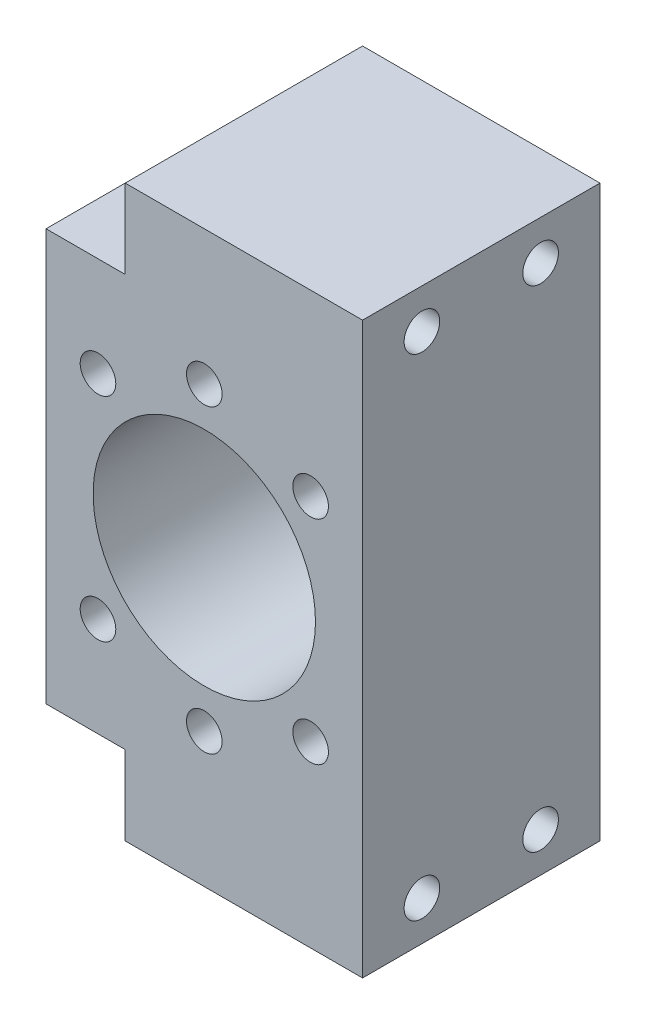
ISO-10303-21;
HEADER;
FILE_DESCRIPTION(('STEP AP214'),'2;1');
FILE_NAME('part.step','',(''),(''),'','','');
FILE_SCHEMA(('AUTOMOTIVE_DESIGN { 1 0 10303 214 1 1 1 1 }'));
ENDSEC;
DATA;
#1=APPLICATION_CONTEXT('core data for automotive mechanical design processes');
#2=APPLICATION_PROTOCOL_DEFINITION('international standard','automotive_design',2000,#1);
#3=PRODUCT_CONTEXT('',#1,'mechanical');
#4=PRODUCT('Part','Part','',(#3));
#5=PRODUCT_RELATED_PRODUCT_CATEGORY('part','',(#4));
#6=PRODUCT_DEFINITION_FORMATION('','',#4);
#7=PRODUCT_DEFINITION_CONTEXT('part definition',#1,'design');
#8=PRODUCT_DEFINITION('design','',#6,#7);
#9=PRODUCT_DEFINITION_SHAPE('','',#8);
#10=(LENGTH_UNIT() NAMED_UNIT(*) SI_UNIT(.MILLI.,.METRE.));
#11=(NAMED_UNIT(*) PLANE_ANGLE_UNIT() SI_UNIT($,.RADIAN.));
#12=(NAMED_UNIT(*) SI_UNIT($,.STERADIAN.) SOLID_ANGLE_UNIT());
#13=UNCERTAINTY_MEASURE_WITH_UNIT(LENGTH_MEASURE(1.E-05),#10,'distance_accuracy_value','');
#14=(GEOMETRIC_REPRESENTATION_CONTEXT(3) GLOBAL_UNCERTAINTY_ASSIGNED_CONTEXT((#13)) GLOBAL_UNIT_ASSIGNED_CONTEXT((#10,
#11,#12)) REPRESENTATION_CONTEXT('',''));
#15=CARTESIAN_POINT('',(0.,0.,0.));
#16=DIRECTION('',(0.,0.,1.));
#17=DIRECTION('',(1.,0.,0.));
#18=AXIS2_PLACEMENT_3D('',#15,#16,#17);
#19=CARTESIAN_POINT('',(-20.,36.,40.));
#20=DIRECTION('',(0.,-1.,0.));
#21=DIRECTION('',(0.,0.,-1.));
#22=AXIS2_PLACEMENT_3D('',#19,#20,#21);
#23=PLANE('',#22);
#24=DIRECTION('',(0.,0.,-1.));
#25=VECTOR('',#24,1.);
#26=CARTESIAN_POINT('',(-10.,36.,10.));
#27=LINE('',#26,#25);
#28=CARTESIAN_POINT('',(-10.,36.,40.));
#29=VERTEX_POINT('',#28);
#30=CARTESIAN_POINT('',(-10.,36.,10.));
#31=VERTEX_POINT('',#30);
#32=EDGE_CURVE('E220',#29,#31,#27,.T.);
#33=ORIENTED_EDGE('',*,*,#32,.F.);
#34=DIRECTION('',(-1.,0.,0.));
#35=VECTOR('',#34,1.);
#36=CARTESIAN_POINT('',(-20.,36.,40.));
#37=LINE('',#36,#35);
#38=CARTESIAN_POINT('',(20.,36.,40.));
#39=VERTEX_POINT('',#38);
#40=EDGE_CURVE('E127',#39,#29,#37,.T.);
#41=ORIENTED_EDGE('',*,*,#40,.F.);
#42=DIRECTION('',(0.,0.,-1.));
#43=VECTOR('',#42,1.);
#44=CARTESIAN_POINT('',(20.,36.,40.));
#45=LINE('',#44,#43);
#46=CARTESIAN_POINT('',(20.,36.,10.));
#47=VERTEX_POINT('',#46);
#48=EDGE_CURVE('E12',#39,#47,#45,.T.);
#49=ORIENTED_EDGE('',*,*,#48,.T.);
#50=DIRECTION('',(-1.,0.,0.));
#51=VECTOR('',#50,1.);
#52=CARTESIAN_POINT('',(-20.,36.,10.));
#53=LINE('',#52,#51);
#54=EDGE_CURVE('E153',#47,#31,#53,.T.);
#55=ORIENTED_EDGE('',*,*,#54,.T.);
#56=EDGE_LOOP('',(#33,#41,#49,#55));
#57=FACE_BOUND('',#56,.T.);
#58=ADVANCED_FACE('F37',(#57),#23,.F.);
#59=CARTESIAN_POINT('',(20.,-36.,40.));
#60=DIRECTION('',(0.,0.,-1.));
#61=DIRECTION('',(-1.,0.,0.));
#62=AXIS2_PLACEMENT_3D('',#59,#60,#61);
#63=PLANE('',#62);
#64=CARTESIAN_POINT('',(13.4350288425444,-13.4350288425444,40.));
#65=DIRECTION('',(0.,0.,1.));
#66=DIRECTION('',(1.,0.,0.));
#67=AXIS2_PLACEMENT_3D('',#64,#65,#66);
#68=CIRCLE('',#67,2.25);
#69=CARTESIAN_POINT('',(15.6850288425444,-13.4350288425444,40.));
#70=VERTEX_POINT('',#69);
#71=EDGE_CURVE('E189',#70,#70,#68,.T.);
#72=ORIENTED_EDGE('',*,*,#71,.F.);
#73=EDGE_LOOP('',(#72));
#74=FACE_BOUND('',#73,.T.);
#75=CARTESIAN_POINT('',(-13.4350288425444,-13.4350288425444,40.));
#76=DIRECTION('',(0.,0.,1.));
#77=DIRECTION('',(1.,0.,0.));
#78=AXIS2_PLACEMENT_3D('',#75,#76,#77);
#79=CIRCLE('',#78,2.25);
#80=CARTESIAN_POINT('',(-11.1850288425444,-13.4350288425444,40.));
#81=VERTEX_POINT('',#80);
#82=EDGE_CURVE('E177',#81,#81,#79,.T.);
#83=ORIENTED_EDGE('',*,*,#82,.F.);
#84=EDGE_LOOP('',(#83));
#85=FACE_BOUND('',#84,.T.);
#86=CARTESIAN_POINT('',(0.,19.,40.));
#87=DIRECTION('',(0.,0.,1.));
#88=DIRECTION('',(1.,0.,0.));
#89=AXIS2_PLACEMENT_3D('',#86,#87,#88);
#90=CIRCLE('',#89,2.25);
#91=CARTESIAN_POINT('',(2.25,19.,40.));
#92=VERTEX_POINT('',#91);
#93=EDGE_CURVE('E165',#92,#92,#90,.T.);
#94=ORIENTED_EDGE('',*,*,#93,.F.);
#95=EDGE_LOOP('',(#94));
#96=FACE_BOUND('',#95,.T.);
#97=DIRECTION('',(0.,-1.,0.));
#98=VECTOR('',#97,1.);
#99=CARTESIAN_POINT('',(-20.,-36.,40.));
#100=LINE('',#99,#98);
#101=CARTESIAN_POINT('',(-20.,26.,40.));
#102=VERTEX_POINT('',#101);
#103=CARTESIAN_POINT('',(-20.,-26.,40.));
#104=VERTEX_POINT('',#103);
#105=EDGE_CURVE('E117',#102,#104,#100,.T.);
#106=ORIENTED_EDGE('',*,*,#105,.T.);
#107=DIRECTION('',(-1.,0.,0.));
#108=VECTOR('',#107,1.);
#109=CARTESIAN_POINT('',(-10.,-26.,40.));
#110=LINE('',#109,#108);
#111=CARTESIAN_POINT('',(-10.,-26.,40.));
#112=VERTEX_POINT('',#111);
#113=EDGE_CURVE('E102',#112,#104,#110,.T.);
#114=ORIENTED_EDGE('',*,*,#113,.F.);
#115=DIRECTION('',(0.,1.,0.));
#116=VECTOR('',#115,1.);
#117=CARTESIAN_POINT('',(-10.,-36.,40.));
#118=LINE('',#117,#116);
#119=CARTESIAN_POINT('',(-10.,-36.,40.));
#120=VERTEX_POINT('',#119);
#121=EDGE_CURVE('E241',#120,#112,#118,.T.);
#122=ORIENTED_EDGE('',*,*,#121,.F.);
#123=DIRECTION('',(1.,0.,0.));
#124=VECTOR('',#123,1.);
#125=CARTESIAN_POINT('',(20.,-36.,40.));
#126=LINE('',#125,#124);
#127=CARTESIAN_POINT('',(20.,-36.,40.));
#128=VERTEX_POINT('',#127);
#129=EDGE_CURVE('E126',#120,#128,#126,.T.);
#130=ORIENTED_EDGE('',*,*,#129,.T.);
#131=DIRECTION('',(0.,1.,0.));
#132=VECTOR('',#131,1.);
#133=CARTESIAN_POINT('',(20.,36.,40.));
#134=LINE('',#133,#132);
#135=EDGE_CURVE('E131',#128,#39,#134,.T.);
#136=ORIENTED_EDGE('',*,*,#135,.T.);
#137=ORIENTED_EDGE('',*,*,#40,.T.);
#138=DIRECTION('',(0.,1.,0.));
#139=VECTOR('',#138,1.);
#140=CARTESIAN_POINT('',(-10.,36.,40.));
#141=LINE('',#140,#139);
#142=CARTESIAN_POINT('',(-10.,26.,40.));
#143=VERTEX_POINT('',#142);
#144=EDGE_CURVE('E223',#143,#29,#141,.T.);
#145=ORIENTED_EDGE('',*,*,#144,.F.);
#146=DIRECTION('',(-1.,0.,0.));
#147=VECTOR('',#146,1.);
#148=CARTESIAN_POINT('',(-10.,26.,40.));
#149=LINE('',#148,#147);
#150=EDGE_CURVE('E125',#143,#102,#149,.T.);
#151=ORIENTED_EDGE('',*,*,#150,.T.);
#152=EDGE_LOOP('',(#106,#114,#122,#130,#136,#137,#145,#151));
#153=FACE_BOUND('',#152,.T.);
#154=CARTESIAN_POINT('',(13.4350288425444,13.4350288425444,40.));
#155=DIRECTION('',(0.,0.,1.));
#156=DIRECTION('',(1.,0.,0.));
#157=AXIS2_PLACEMENT_3D('',#154,#155,#156);
#158=CIRCLE('',#157,2.25);
#159=CARTESIAN_POINT('',(15.6850288425444,13.4350288425444,40.));
#160=VERTEX_POINT('',#159);
#161=EDGE_CURVE('E159',#160,#160,#158,.T.);
#162=ORIENTED_EDGE('',*,*,#161,.F.);
#163=EDGE_LOOP('',(#162));
#164=FACE_BOUND('',#163,.T.);
#165=CARTESIAN_POINT('',(-13.4350288425445,13.4350288425444,40.));
#166=DIRECTION('',(0.,0.,1.));
#167=DIRECTION('',(1.,0.,0.));
#168=AXIS2_PLACEMENT_3D('',#165,#166,#167);
#169=CIRCLE('',#168,2.25);
#170=CARTESIAN_POINT('',(-11.1850288425445,13.4350288425444,40.));
#171=VERTEX_POINT('',#170);
#172=EDGE_CURVE('E171',#171,#171,#169,.T.);
#173=ORIENTED_EDGE('',*,*,#172,.F.);
#174=EDGE_LOOP('',(#173));
#175=FACE_BOUND('',#174,.T.);
#176=CARTESIAN_POINT('',(0.,-19.,40.));
#177=DIRECTION('',(0.,0.,1.));
#178=DIRECTION('',(1.,0.,0.));
#179=AXIS2_PLACEMENT_3D('',#176,#177,#178);
#180=CIRCLE('',#179,2.25);
#181=CARTESIAN_POINT('',(2.25,-19.,40.));
#182=VERTEX_POINT('',#181);
#183=EDGE_CURVE('E183',#182,#182,#180,.T.);
#184=ORIENTED_EDGE('',*,*,#183,.F.);
#185=EDGE_LOOP('',(#184));
#186=FACE_BOUND('',#185,.T.);
#187=CARTESIAN_POINT('',(0.,0.,40.));
#188=DIRECTION('',(0.,0.,1.));
#189=DIRECTION('',(1.,0.,0.));
#190=AXIS2_PLACEMENT_3D('',#187,#188,#189);
#191=CIRCLE('',#190,14.05);
#192=CARTESIAN_POINT('',(14.05,0.,40.));
#193=VERTEX_POINT('',#192);
#194=EDGE_CURVE('E195',#193,#193,#191,.T.);
#195=ORIENTED_EDGE('',*,*,#194,.F.);
#196=EDGE_LOOP('',(#195));
#197=FACE_BOUND('',#196,.T.);
#198=ADVANCED_FACE('F122',(#74,#85,#96,#153,#164,#175,#186,#197),#63,.F.);
#199=CARTESIAN_POINT('',(20.,-36.,10.));
#200=DIRECTION('',(0.,0.,-1.));
#201=DIRECTION('',(-1.,0.,0.));
#202=AXIS2_PLACEMENT_3D('',#199,#200,#201);
#203=PLANE('',#202);
#204=DIRECTION('',(-1.,0.,0.));
#205=VECTOR('',#204,1.);
#206=CARTESIAN_POINT('',(-10.,-26.,10.));
#207=LINE('',#206,#205);
#208=CARTESIAN_POINT('',(-10.,-26.,10.));
#209=VERTEX_POINT('',#208);
#210=CARTESIAN_POINT('',(-20.,-26.,10.));
#211=VERTEX_POINT('',#210);
#212=EDGE_CURVE('E111',#209,#211,#207,.T.);
#213=ORIENTED_EDGE('',*,*,#212,.T.);
#214=DIRECTION('',(0.,-1.,0.));
#215=VECTOR('',#214,1.);
#216=CARTESIAN_POINT('',(-20.,-36.,10.));
#217=LINE('',#216,#215);
#218=CARTESIAN_POINT('',(-20.,26.,10.));
#219=VERTEX_POINT('',#218);
#220=EDGE_CURVE('E119',#219,#211,#217,.T.);
#221=ORIENTED_EDGE('',*,*,#220,.F.);
#222=DIRECTION('',(-1.,0.,0.));
#223=VECTOR('',#222,1.);
#224=CARTESIAN_POINT('',(-10.,26.,10.));
#225=LINE('',#224,#223);
#226=CARTESIAN_POINT('',(-10.,26.,10.));
#227=VERTEX_POINT('',#226);
#228=EDGE_CURVE('E59',#227,#219,#225,.T.);
#229=ORIENTED_EDGE('',*,*,#228,.F.);
#230=DIRECTION('',(0.,-1.,0.));
#231=VECTOR('',#230,1.);
#232=CARTESIAN_POINT('',(-10.,36.,10.));
#233=LINE('',#232,#231);
#234=EDGE_CURVE('E228',#31,#227,#233,.T.);
#235=ORIENTED_EDGE('',*,*,#234,.F.);
#236=ORIENTED_EDGE('',*,*,#54,.F.);
#237=DIRECTION('',(0.,1.,0.));
#238=VECTOR('',#237,1.);
#239=CARTESIAN_POINT('',(20.,0.,10.));
#240=LINE('',#239,#238);
#241=CARTESIAN_POINT('',(20.,-36.,10.));
#242=VERTEX_POINT('',#241);
#243=EDGE_CURVE('E141',#242,#47,#240,.T.);
#244=ORIENTED_EDGE('',*,*,#243,.F.);
#245=DIRECTION('',(1.,0.,0.));
#246=VECTOR('',#245,1.);
#247=CARTESIAN_POINT('',(20.,-36.,10.));
#248=LINE('',#247,#246);
#249=CARTESIAN_POINT('',(-10.,-36.,10.));
#250=VERTEX_POINT('',#249);
#251=EDGE_CURVE('E150',#250,#242,#248,.T.);
#252=ORIENTED_EDGE('',*,*,#251,.F.);
#253=DIRECTION('',(0.,-1.,0.));
#254=VECTOR('',#253,1.);
#255=CARTESIAN_POINT('',(-10.,-36.,10.));
#256=LINE('',#255,#254);
#257=EDGE_CURVE('E51',#209,#250,#256,.T.);
#258=ORIENTED_EDGE('',*,*,#257,.F.);
#259=EDGE_LOOP('',(#213,#221,#229,#235,#236,#244,#252,#258));
#260=FACE_BOUND('',#259,.T.);
#261=CARTESIAN_POINT('',(13.4350288425444,-13.4350288425444,10.));
#262=DIRECTION('',(0.,0.,1.));
#263=DIRECTION('',(1.,0.,0.));
#264=AXIS2_PLACEMENT_3D('',#261,#262,#263);
#265=CIRCLE('',#264,2.25);
#266=CARTESIAN_POINT('',(15.6850288425444,-13.4350288425444,10.));
#267=VERTEX_POINT('',#266);
#268=EDGE_CURVE('E192',#267,#267,#265,.T.);
#269=ORIENTED_EDGE('',*,*,#268,.T.);
#270=EDGE_LOOP('',(#269));
#271=FACE_BOUND('',#270,.T.);
#272=CARTESIAN_POINT('',(-13.4350288425444,-13.4350288425444,10.));
#273=DIRECTION('',(0.,0.,1.));
#274=DIRECTION('',(1.,0.,0.));
#275=AXIS2_PLACEMENT_3D('',#272,#273,#274);
#276=CIRCLE('',#275,2.25);
#277=CARTESIAN_POINT('',(-11.1850288425444,-13.4350288425444,10.));
#278=VERTEX_POINT('',#277);
#279=EDGE_CURVE('E180',#278,#278,#276,.T.);
#280=ORIENTED_EDGE('',*,*,#279,.T.);
#281=EDGE_LOOP('',(#280));
#282=FACE_BOUND('',#281,.T.);
#283=CARTESIAN_POINT('',(0.,19.,10.));
#284=DIRECTION('',(0.,0.,1.));
#285=DIRECTION('',(1.,0.,0.));
#286=AXIS2_PLACEMENT_3D('',#283,#284,#285);
#287=CIRCLE('',#286,2.25);
#288=CARTESIAN_POINT('',(2.25,19.,10.));
#289=VERTEX_POINT('',#288);
#290=EDGE_CURVE('E168',#289,#289,#287,.T.);
#291=ORIENTED_EDGE('',*,*,#290,.T.);
#292=EDGE_LOOP('',(#291));
#293=FACE_BOUND('',#292,.T.);
#294=CARTESIAN_POINT('',(13.4350288425444,13.4350288425444,10.));
#295=DIRECTION('',(0.,0.,1.));
#296=DIRECTION('',(1.,0.,0.));
#297=AXIS2_PLACEMENT_3D('',#294,#295,#296);
#298=CIRCLE('',#297,2.25);
#299=CARTESIAN_POINT('',(15.6850288425444,13.4350288425444,10.));
#300=VERTEX_POINT('',#299);
#301=EDGE_CURVE('E162',#300,#300,#298,.T.);
#302=ORIENTED_EDGE('',*,*,#301,.T.);
#303=EDGE_LOOP('',(#302));
#304=FACE_BOUND('',#303,.T.);
#305=CARTESIAN_POINT('',(-13.4350288425445,13.4350288425444,10.));
#306=DIRECTION('',(0.,0.,1.));
#307=DIRECTION('',(1.,0.,0.));
#308=AXIS2_PLACEMENT_3D('',#305,#306,#307);
#309=CIRCLE('',#308,2.25);
#310=CARTESIAN_POINT('',(-11.1850288425445,13.4350288425444,10.));
#311=VERTEX_POINT('',#310);
#312=EDGE_CURVE('E174',#311,#311,#309,.T.);
#313=ORIENTED_EDGE('',*,*,#312,.T.);
#314=EDGE_LOOP('',(#313));
#315=FACE_BOUND('',#314,.T.);
#316=CARTESIAN_POINT('',(0.,-19.,10.));
#317=DIRECTION('',(0.,0.,1.));
#318=DIRECTION('',(1.,0.,0.));
#319=AXIS2_PLACEMENT_3D('',#316,#317,#318);
#320=CIRCLE('',#319,2.25);
#321=CARTESIAN_POINT('',(2.25,-19.,10.));
#322=VERTEX_POINT('',#321);
#323=EDGE_CURVE('E186',#322,#322,#320,.T.);
#324=ORIENTED_EDGE('',*,*,#323,.T.);
#325=EDGE_LOOP('',(#324));
#326=FACE_BOUND('',#325,.T.);
#327=CARTESIAN_POINT('',(0.,0.,10.));
#328=DIRECTION('',(0.,0.,1.));
#329=DIRECTION('',(1.,0.,0.));
#330=AXIS2_PLACEMENT_3D('',#327,#328,#329);
#331=CIRCLE('',#330,14.05);
#332=CARTESIAN_POINT('',(14.05,0.,10.));
#333=VERTEX_POINT('',#332);
#334=EDGE_CURVE('E198',#333,#333,#331,.T.);
#335=ORIENTED_EDGE('',*,*,#334,.T.);
#336=EDGE_LOOP('',(#335));
#337=FACE_BOUND('',#336,.T.);
#338=ADVANCED_FACE('F148',(#260,#271,#282,#293,#304,#315,#326,#337),#203,.T.);
#339=CARTESIAN_POINT('',(-20.,-36.,40.));
#340=DIRECTION('',(1.,0.,0.));
#341=DIRECTION('',(0.,0.,-1.));
#342=AXIS2_PLACEMENT_3D('',#339,#340,#341);
#343=PLANE('',#342);
#344=ORIENTED_EDGE('',*,*,#220,.T.);
#345=DIRECTION('',(0.,0.,-1.));
#346=VECTOR('',#345,1.);
#347=CARTESIAN_POINT('',(-20.,-26.,10.));
#348=LINE('',#347,#346);
#349=EDGE_CURVE('E105',#104,#211,#348,.T.);
#350=ORIENTED_EDGE('',*,*,#349,.F.);
#351=ORIENTED_EDGE('',*,*,#105,.F.);
#352=DIRECTION('',(0.,0.,1.));
#353=VECTOR('',#352,1.);
#354=CARTESIAN_POINT('',(-20.,26.,10.));
#355=LINE('',#354,#353);
#356=EDGE_CURVE('E231',#219,#102,#355,.T.);
#357=ORIENTED_EDGE('',*,*,#356,.F.);
#358=EDGE_LOOP('',(#344,#350,#351,#357));
#359=FACE_BOUND('',#358,.T.);
#360=ADVANCED_FACE('F116',(#359),#343,.F.);
#361=CARTESIAN_POINT('',(20.,-36.,40.));
#362=DIRECTION('',(0.,1.,0.));
#363=DIRECTION('',(0.,0.,1.));
#364=AXIS2_PLACEMENT_3D('',#361,#362,#363);
#365=PLANE('',#364);
#366=ORIENTED_EDGE('',*,*,#129,.F.);
#367=DIRECTION('',(0.,0.,1.));
#368=VECTOR('',#367,1.);
#369=CARTESIAN_POINT('',(-10.,-36.,10.));
#370=LINE('',#369,#368);
#371=EDGE_CURVE('E243',#250,#120,#370,.T.);
#372=ORIENTED_EDGE('',*,*,#371,.F.);
#373=ORIENTED_EDGE('',*,*,#251,.T.);
#374=DIRECTION('',(0.,0.,-1.));
#375=VECTOR('',#374,1.);
#376=CARTESIAN_POINT('',(20.,-36.,40.));
#377=LINE('',#376,#375);
#378=EDGE_CURVE('E44',#128,#242,#377,.T.);
#379=ORIENTED_EDGE('',*,*,#378,.F.);
#380=EDGE_LOOP('',(#366,#372,#373,#379));
#381=FACE_BOUND('',#380,.T.);
#382=ADVANCED_FACE('F247',(#381),#365,.F.);
#383=CARTESIAN_POINT('',(20.,0.,40.));
#384=DIRECTION('',(-1.,0.,0.));
#385=DIRECTION('',(0.,-1.,0.));
#386=AXIS2_PLACEMENT_3D('',#383,#384,#385);
#387=PLANE('',#386);
#388=CARTESIAN_POINT('',(20.,31.,17.5));
#389=DIRECTION('',(1.,0.,0.));
#390=DIRECTION('',(0.,0.,-1.));
#391=AXIS2_PLACEMENT_3D('',#388,#389,#390);
#392=CIRCLE('',#391,2.25);
#393=CARTESIAN_POINT('',(20.,31.,15.25));
#394=VERTEX_POINT('',#393);
#395=EDGE_CURVE('E210',#394,#394,#392,.T.);
#396=ORIENTED_EDGE('',*,*,#395,.F.);
#397=EDGE_LOOP('',(#396));
#398=FACE_BOUND('',#397,.T.);
#399=CARTESIAN_POINT('',(20.,-31.,32.5));
#400=DIRECTION('',(1.,0.,0.));
#401=DIRECTION('',(0.,1.,0.));
#402=AXIS2_PLACEMENT_3D('',#399,#400,#401);
#403=CIRCLE('',#402,2.25);
#404=CARTESIAN_POINT('',(20.,-28.75,32.5));
#405=VERTEX_POINT('',#404);
#406=EDGE_CURVE('E207',#405,#405,#403,.T.);
#407=ORIENTED_EDGE('',*,*,#406,.F.);
#408=EDGE_LOOP('',(#407));
#409=FACE_BOUND('',#408,.T.);
#410=CARTESIAN_POINT('',(20.,-31.,17.5));
#411=DIRECTION('',(1.,0.,0.));
#412=DIRECTION('',(0.,1.,0.));
#413=AXIS2_PLACEMENT_3D('',#410,#411,#412);
#414=CIRCLE('',#413,2.25);
#415=CARTESIAN_POINT('',(20.,-28.75,17.5));
#416=VERTEX_POINT('',#415);
#417=EDGE_CURVE('E204',#416,#416,#414,.T.);
#418=ORIENTED_EDGE('',*,*,#417,.F.);
#419=EDGE_LOOP('',(#418));
#420=FACE_BOUND('',#419,.T.);
#421=CARTESIAN_POINT('',(20.,31.,32.5));
#422=DIRECTION('',(1.,0.,0.));
#423=DIRECTION('',(0.,1.,0.));
#424=AXIS2_PLACEMENT_3D('',#421,#422,#423);
#425=CIRCLE('',#424,2.25);
#426=CARTESIAN_POINT('',(20.,33.25,32.5));
#427=VERTEX_POINT('',#426);
#428=EDGE_CURVE('E201',#427,#427,#425,.T.);
#429=ORIENTED_EDGE('',*,*,#428,.F.);
#430=EDGE_LOOP('',(#429));
#431=FACE_BOUND('',#430,.T.);
#432=ORIENTED_EDGE('',*,*,#243,.T.);
#433=ORIENTED_EDGE('',*,*,#48,.F.);
#434=ORIENTED_EDGE('',*,*,#135,.F.);
#435=ORIENTED_EDGE('',*,*,#378,.T.);
#436=EDGE_LOOP('',(#432,#433,#434,#435));
#437=FACE_BOUND('',#436,.T.);
#438=ADVANCED_FACE('F139',(#398,#409,#420,#431,#437),#387,.F.);
#439=CARTESIAN_POINT('',(13.4350288425444,13.4350288425444,40.));
#440=DIRECTION('',(0.,0.,-1.));
#441=DIRECTION('',(-1.,0.,0.));
#442=AXIS2_PLACEMENT_3D('',#439,#440,#441);
#443=CYLINDRICAL_SURFACE('',#442,2.25);
#444=ORIENTED_EDGE('',*,*,#161,.T.);
#445=EDGE_LOOP('',(#444));
#446=FACE_BOUND('',#445,.T.);
#447=ORIENTED_EDGE('',*,*,#301,.F.);
#448=EDGE_LOOP('',(#447));
#449=FACE_BOUND('',#448,.T.);
#450=ADVANCED_FACE('F255',(#446,#449),#443,.F.);
#451=CARTESIAN_POINT('',(0.,19.,40.));
#452=DIRECTION('',(0.,0.,-1.));
#453=DIRECTION('',(-1.,0.,0.));
#454=AXIS2_PLACEMENT_3D('',#451,#452,#453);
#455=CYLINDRICAL_SURFACE('',#454,2.25);
#456=ORIENTED_EDGE('',*,*,#93,.T.);
#457=EDGE_LOOP('',(#456));
#458=FACE_BOUND('',#457,.T.);
#459=ORIENTED_EDGE('',*,*,#290,.F.);
#460=EDGE_LOOP('',(#459));
#461=FACE_BOUND('',#460,.T.);
#462=ADVANCED_FACE('F316',(#458,#461),#455,.F.);
#463=CARTESIAN_POINT('',(-13.4350288425445,13.4350288425444,40.));
#464=DIRECTION('',(0.,0.,-1.));
#465=DIRECTION('',(-1.,0.,0.));
#466=AXIS2_PLACEMENT_3D('',#463,#464,#465);
#467=CYLINDRICAL_SURFACE('',#466,2.25);
#468=ORIENTED_EDGE('',*,*,#172,.T.);
#469=EDGE_LOOP('',(#468));
#470=FACE_BOUND('',#469,.T.);
#471=ORIENTED_EDGE('',*,*,#312,.F.);
#472=EDGE_LOOP('',(#471));
#473=FACE_BOUND('',#472,.T.);
#474=ADVANCED_FACE('F312',(#470,#473),#467,.F.);
#475=CARTESIAN_POINT('',(-13.4350288425444,-13.4350288425444,40.));
#476=DIRECTION('',(0.,0.,-1.));
#477=DIRECTION('',(-1.,0.,0.));
#478=AXIS2_PLACEMENT_3D('',#475,#476,#477);
#479=CYLINDRICAL_SURFACE('',#478,2.25);
#480=ORIENTED_EDGE('',*,*,#82,.T.);
#481=EDGE_LOOP('',(#480));
#482=FACE_BOUND('',#481,.T.);
#483=ORIENTED_EDGE('',*,*,#279,.F.);
#484=EDGE_LOOP('',(#483));
#485=FACE_BOUND('',#484,.T.);
#486=ADVANCED_FACE('F308',(#482,#485),#479,.F.);
#487=CARTESIAN_POINT('',(0.,-19.,40.));
#488=DIRECTION('',(0.,0.,-1.));
#489=DIRECTION('',(-1.,0.,0.));
#490=AXIS2_PLACEMENT_3D('',#487,#488,#489);
#491=CYLINDRICAL_SURFACE('',#490,2.25);
#492=ORIENTED_EDGE('',*,*,#183,.T.);
#493=EDGE_LOOP('',(#492));
#494=FACE_BOUND('',#493,.T.);
#495=ORIENTED_EDGE('',*,*,#323,.F.);
#496=EDGE_LOOP('',(#495));
#497=FACE_BOUND('',#496,.T.);
#498=ADVANCED_FACE('F304',(#494,#497),#491,.F.);
#499=CARTESIAN_POINT('',(13.4350288425444,-13.4350288425444,40.));
#500=DIRECTION('',(0.,0.,-1.));
#501=DIRECTION('',(-1.,0.,0.));
#502=AXIS2_PLACEMENT_3D('',#499,#500,#501);
#503=CYLINDRICAL_SURFACE('',#502,2.25);
#504=ORIENTED_EDGE('',*,*,#71,.T.);
#505=EDGE_LOOP('',(#504));
#506=FACE_BOUND('',#505,.T.);
#507=ORIENTED_EDGE('',*,*,#268,.F.);
#508=EDGE_LOOP('',(#507));
#509=FACE_BOUND('',#508,.T.);
#510=ADVANCED_FACE('F300',(#506,#509),#503,.F.);
#511=CARTESIAN_POINT('',(0.,0.,40.));
#512=DIRECTION('',(0.,0.,-1.));
#513=DIRECTION('',(-1.,0.,0.));
#514=AXIS2_PLACEMENT_3D('',#511,#512,#513);
#515=CYLINDRICAL_SURFACE('',#514,14.05);
#516=ORIENTED_EDGE('',*,*,#194,.T.);
#517=EDGE_LOOP('',(#516));
#518=FACE_BOUND('',#517,.T.);
#519=ORIENTED_EDGE('',*,*,#334,.F.);
#520=EDGE_LOOP('',(#519));
#521=FACE_BOUND('',#520,.T.);
#522=ADVANCED_FACE('F296',(#518,#521),#515,.F.);
#523=CARTESIAN_POINT('',(-10.,31.,32.5));
#524=DIRECTION('',(1.,0.,0.));
#525=DIRECTION('',(0.,1.,0.));
#526=AXIS2_PLACEMENT_3D('',#523,#524,#525);
#527=CYLINDRICAL_SURFACE('',#526,2.25);
#528=CARTESIAN_POINT('',(-10.,31.,32.5));
#529=DIRECTION('',(-1.,0.,0.));
#530=DIRECTION('',(0.,0.,1.));
#531=AXIS2_PLACEMENT_3D('',#528,#529,#530);
#532=CIRCLE('',#531,2.25);
#533=CARTESIAN_POINT('',(-10.,31.,34.75));
#534=VERTEX_POINT('',#533);
#535=EDGE_CURVE('E213',#534,#534,#532,.F.);
#536=ORIENTED_EDGE('',*,*,#535,.F.);
#537=EDGE_LOOP('',(#536));
#538=FACE_BOUND('',#537,.T.);
#539=ORIENTED_EDGE('',*,*,#428,.T.);
#540=EDGE_LOOP('',(#539));
#541=FACE_BOUND('',#540,.T.);
#542=ADVANCED_FACE('F292',(#538,#541),#527,.F.);
#543=CARTESIAN_POINT('',(-9.99999999999999,-31.,17.5));
#544=DIRECTION('',(1.,0.,0.));
#545=DIRECTION('',(0.,1.,0.));
#546=AXIS2_PLACEMENT_3D('',#543,#544,#545);
#547=CYLINDRICAL_SURFACE('',#546,2.25);
#548=CARTESIAN_POINT('',(-10.,-31.,17.5));
#549=DIRECTION('',(1.,0.,0.));
#550=DIRECTION('',(0.,0.,-1.));
#551=AXIS2_PLACEMENT_3D('',#548,#549,#550);
#552=CIRCLE('',#551,2.25);
#553=CARTESIAN_POINT('',(-10.,-31.,15.25));
#554=VERTEX_POINT('',#553);
#555=EDGE_CURVE('E233',#554,#554,#552,.F.);
#556=ORIENTED_EDGE('',*,*,#555,.T.);
#557=EDGE_LOOP('',(#556));
#558=FACE_BOUND('',#557,.T.);
#559=ORIENTED_EDGE('',*,*,#417,.T.);
#560=EDGE_LOOP('',(#559));
#561=FACE_BOUND('',#560,.T.);
#562=ADVANCED_FACE('F288',(#558,#561),#547,.F.);
#563=CARTESIAN_POINT('',(-9.99999999999999,-31.,32.5));
#564=DIRECTION('',(1.,0.,0.));
#565=DIRECTION('',(0.,1.,0.));
#566=AXIS2_PLACEMENT_3D('',#563,#564,#565);
#567=CYLINDRICAL_SURFACE('',#566,2.25);
#568=CARTESIAN_POINT('',(-10.,-31.,32.5));
#569=DIRECTION('',(1.,0.,0.));
#570=DIRECTION('',(0.,0.,-1.));
#571=AXIS2_PLACEMENT_3D('',#568,#569,#570);
#572=CIRCLE('',#571,2.25);
#573=CARTESIAN_POINT('',(-10.,-31.,30.25));
#574=VERTEX_POINT('',#573);
#575=EDGE_CURVE('E236',#574,#574,#572,.F.);
#576=ORIENTED_EDGE('',*,*,#575,.T.);
#577=EDGE_LOOP('',(#576));
#578=FACE_BOUND('',#577,.T.);
#579=ORIENTED_EDGE('',*,*,#406,.T.);
#580=EDGE_LOOP('',(#579));
#581=FACE_BOUND('',#580,.T.);
#582=ADVANCED_FACE('F284',(#578,#581),#567,.F.);
#583=CARTESIAN_POINT('',(-10.,31.,17.5));
#584=DIRECTION('',(1.,0.,0.));
#585=DIRECTION('',(0.,1.,0.));
#586=AXIS2_PLACEMENT_3D('',#583,#584,#585);
#587=CYLINDRICAL_SURFACE('',#586,2.25);
#588=ORIENTED_EDGE('',*,*,#395,.T.);
#589=EDGE_LOOP('',(#588));
#590=FACE_BOUND('',#589,.T.);
#591=CARTESIAN_POINT('',(-10.,31.,17.5));
#592=DIRECTION('',(-1.,0.,0.));
#593=DIRECTION('',(0.,0.,1.));
#594=AXIS2_PLACEMENT_3D('',#591,#592,#593);
#595=CIRCLE('',#594,2.25);
#596=CARTESIAN_POINT('',(-10.,31.,19.75));
#597=VERTEX_POINT('',#596);
#598=EDGE_CURVE('E216',#597,#597,#595,.F.);
#599=ORIENTED_EDGE('',*,*,#598,.F.);
#600=EDGE_LOOP('',(#599));
#601=FACE_BOUND('',#600,.T.);
#602=ADVANCED_FACE('F278',(#590,#601),#587,.F.);
#603=CARTESIAN_POINT('',(-10.,26.,10.));
#604=DIRECTION('',(-1.,0.,0.));
#605=DIRECTION('',(0.,0.,1.));
#606=AXIS2_PLACEMENT_3D('',#603,#604,#605);
#607=PLANE('',#606);
#608=ORIENTED_EDGE('',*,*,#598,.T.);
#609=EDGE_LOOP('',(#608));
#610=FACE_BOUND('',#609,.T.);
#611=ORIENTED_EDGE('',*,*,#234,.T.);
#612=DIRECTION('',(0.,0.,1.));
#613=VECTOR('',#612,1.);
#614=CARTESIAN_POINT('',(-10.,26.,10.));
#615=LINE('',#614,#613);
#616=EDGE_CURVE('E225',#227,#143,#615,.T.);
#617=ORIENTED_EDGE('',*,*,#616,.T.);
#618=ORIENTED_EDGE('',*,*,#144,.T.);
#619=ORIENTED_EDGE('',*,*,#32,.T.);
#620=EDGE_LOOP('',(#611,#617,#618,#619));
#621=FACE_BOUND('',#620,.T.);
#622=ORIENTED_EDGE('',*,*,#535,.T.);
#623=EDGE_LOOP('',(#622));
#624=FACE_BOUND('',#623,.T.);
#625=ADVANCED_FACE('F268',(#610,#621,#624),#607,.T.);
#626=CARTESIAN_POINT('',(-10.,26.,10.));
#627=DIRECTION('',(0.,-1.,0.));
#628=DIRECTION('',(0.,0.,-1.));
#629=AXIS2_PLACEMENT_3D('',#626,#627,#628);
#630=PLANE('',#629);
#631=ORIENTED_EDGE('',*,*,#356,.T.);
#632=ORIENTED_EDGE('',*,*,#150,.F.);
#633=ORIENTED_EDGE('',*,*,#616,.F.);
#634=ORIENTED_EDGE('',*,*,#228,.T.);
#635=EDGE_LOOP('',(#631,#632,#633,#634));
#636=FACE_BOUND('',#635,.T.);
#637=ADVANCED_FACE('F270',(#636),#630,.F.);
#638=CARTESIAN_POINT('',(-10.,-26.,10.));
#639=DIRECTION('',(1.,0.,0.));
#640=DIRECTION('',(0.,0.,-1.));
#641=AXIS2_PLACEMENT_3D('',#638,#639,#640);
#642=PLANE('',#641);
#643=ORIENTED_EDGE('',*,*,#575,.F.);
#644=EDGE_LOOP('',(#643));
#645=FACE_BOUND('',#644,.T.);
#646=ORIENTED_EDGE('',*,*,#257,.T.);
#647=ORIENTED_EDGE('',*,*,#371,.T.);
#648=ORIENTED_EDGE('',*,*,#121,.T.);
#649=DIRECTION('',(0.,0.,-1.));
#650=VECTOR('',#649,1.);
#651=CARTESIAN_POINT('',(-10.,-26.,10.));
#652=LINE('',#651,#650);
#653=EDGE_CURVE('E107',#112,#209,#652,.T.);
#654=ORIENTED_EDGE('',*,*,#653,.T.);
#655=EDGE_LOOP('',(#646,#647,#648,#654));
#656=FACE_BOUND('',#655,.T.);
#657=ORIENTED_EDGE('',*,*,#555,.F.);
#658=EDGE_LOOP('',(#657));
#659=FACE_BOUND('',#658,.T.);
#660=ADVANCED_FACE('F245',(#645,#656,#659),#642,.F.);
#661=CARTESIAN_POINT('',(-10.,-26.,10.));
#662=DIRECTION('',(0.,1.,0.));
#663=DIRECTION('',(0.,0.,1.));
#664=AXIS2_PLACEMENT_3D('',#661,#662,#663);
#665=PLANE('',#664);
#666=ORIENTED_EDGE('',*,*,#349,.T.);
#667=ORIENTED_EDGE('',*,*,#212,.F.);
#668=ORIENTED_EDGE('',*,*,#653,.F.);
#669=ORIENTED_EDGE('',*,*,#113,.T.);
#670=EDGE_LOOP('',(#666,#667,#668,#669));
#671=FACE_BOUND('',#670,.T.);
#672=ADVANCED_FACE('F104',(#671),#665,.F.);
#673=CLOSED_SHELL('',(#58,#198,#338,#360,#382,#438,#450,#462,#474,#486,#498,#510,#522,#542,#562,
#582,#602,#625,#637,#660,#672));
#674=MANIFOLD_SOLID_BREP('B2',#673);
#675=ADVANCED_BREP_SHAPE_REPRESENTATION('',(#18,#674),#14);
#676=SHAPE_DEFINITION_REPRESENTATION(#9,#675);
ENDSEC;
END-ISO-10303-21;
